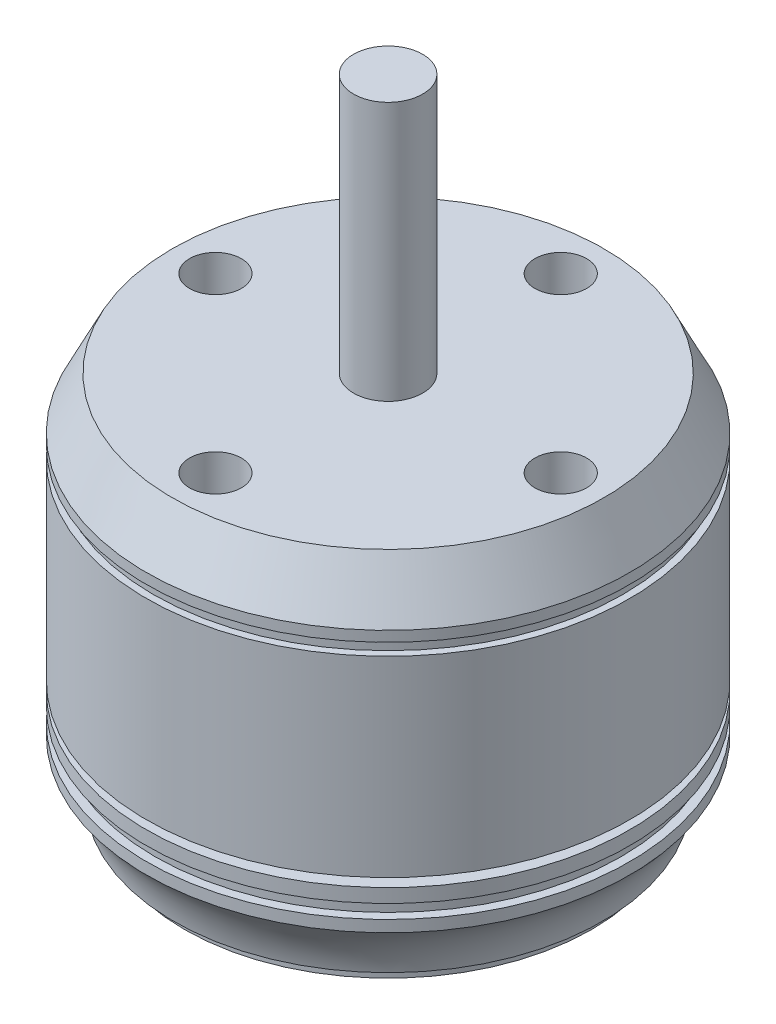
ISO-10303-21;
HEADER;
FILE_DESCRIPTION(('STEP AP214'),'2;1');
FILE_NAME('part.step','',(''),(''),'','','');
FILE_SCHEMA(('AUTOMOTIVE_DESIGN { 1 0 10303 214 1 1 1 1 }'));
ENDSEC;
DATA;
#1=APPLICATION_CONTEXT('core data for automotive mechanical design processes');
#2=APPLICATION_PROTOCOL_DEFINITION('international standard','automotive_design',2000,#1);
#3=PRODUCT_CONTEXT('',#1,'mechanical');
#4=PRODUCT('Part','Part','',(#3));
#5=PRODUCT_RELATED_PRODUCT_CATEGORY('part','',(#4));
#6=PRODUCT_DEFINITION_FORMATION('','',#4);
#7=PRODUCT_DEFINITION_CONTEXT('part definition',#1,'design');
#8=PRODUCT_DEFINITION('design','',#6,#7);
#9=PRODUCT_DEFINITION_SHAPE('','',#8);
#10=(LENGTH_UNIT() NAMED_UNIT(*) SI_UNIT(.MILLI.,.METRE.));
#11=(NAMED_UNIT(*) PLANE_ANGLE_UNIT() SI_UNIT($,.RADIAN.));
#12=(NAMED_UNIT(*) SI_UNIT($,.STERADIAN.) SOLID_ANGLE_UNIT());
#13=UNCERTAINTY_MEASURE_WITH_UNIT(LENGTH_MEASURE(1.E-05),#10,'distance_accuracy_value','');
#14=(GEOMETRIC_REPRESENTATION_CONTEXT(3) GLOBAL_UNCERTAINTY_ASSIGNED_CONTEXT((#13)) GLOBAL_UNIT_ASSIGNED_CONTEXT((#10,
#11,#12)) REPRESENTATION_CONTEXT('',''));
#15=CARTESIAN_POINT('',(0.,0.,0.));
#16=DIRECTION('',(0.,0.,1.));
#17=DIRECTION('',(1.,0.,0.));
#18=AXIS2_PLACEMENT_3D('',#15,#16,#17);
#19=CARTESIAN_POINT('',(0.,0.,0.));
#20=DIRECTION('',(0.,1.,0.));
#21=DIRECTION('',(-1.,0.,0.));
#22=AXIS2_PLACEMENT_3D('',#19,#20,#21);
#23=PLANE('',#22);
#24=CARTESIAN_POINT('',(9.5,0.,0.));
#25=DIRECTION('',(0.,-1.,0.));
#26=DIRECTION('',(1.,0.,0.));
#27=AXIS2_PLACEMENT_3D('',#24,#25,#26);
#28=CIRCLE('',#27,1.5);
#29=CARTESIAN_POINT('',(11.,0.,0.));
#30=VERTEX_POINT('',#29);
#31=EDGE_CURVE('E121',#30,#30,#28,.T.);
#32=ORIENTED_EDGE('',*,*,#31,.F.);
#33=EDGE_LOOP('',(#32));
#34=FACE_BOUND('',#33,.T.);
#35=CARTESIAN_POINT('',(0.,0.,8.));
#36=DIRECTION('',(0.,-1.,0.));
#37=DIRECTION('',(1.,0.,0.));
#38=AXIS2_PLACEMENT_3D('',#35,#36,#37);
#39=CIRCLE('',#38,1.5);
#40=CARTESIAN_POINT('',(1.5,0.,8.));
#41=VERTEX_POINT('',#40);
#42=EDGE_CURVE('E115',#41,#41,#39,.T.);
#43=ORIENTED_EDGE('',*,*,#42,.F.);
#44=EDGE_LOOP('',(#43));
#45=FACE_BOUND('',#44,.T.);
#46=CARTESIAN_POINT('',(0.,0.,-8.));
#47=DIRECTION('',(0.,-1.,0.));
#48=DIRECTION('',(1.,0.,0.));
#49=AXIS2_PLACEMENT_3D('',#46,#47,#48);
#50=CIRCLE('',#49,1.5);
#51=CARTESIAN_POINT('',(1.5,0.,-8.));
#52=VERTEX_POINT('',#51);
#53=EDGE_CURVE('E109',#52,#52,#50,.T.);
#54=ORIENTED_EDGE('',*,*,#53,.F.);
#55=EDGE_LOOP('',(#54));
#56=FACE_BOUND('',#55,.T.);
#57=CARTESIAN_POINT('',(-9.5,0.,0.));
#58=DIRECTION('',(0.,-1.,0.));
#59=DIRECTION('',(1.,0.,0.));
#60=AXIS2_PLACEMENT_3D('',#57,#58,#59);
#61=CIRCLE('',#60,1.5);
#62=CARTESIAN_POINT('',(-8.,0.,0.));
#63=VERTEX_POINT('',#62);
#64=EDGE_CURVE('E102',#63,#63,#61,.T.);
#65=ORIENTED_EDGE('',*,*,#64,.F.);
#66=EDGE_LOOP('',(#65));
#67=FACE_BOUND('',#66,.T.);
#68=CARTESIAN_POINT('',(0.,0.,0.));
#69=DIRECTION('',(0.,1.,0.));
#70=DIRECTION('',(-1.,0.,0.));
#71=AXIS2_PLACEMENT_3D('',#68,#69,#70);
#72=CIRCLE('',#71,11.8);
#73=CARTESIAN_POINT('',(-11.8,0.,0.));
#74=VERTEX_POINT('',#73);
#75=EDGE_CURVE('E10',#74,#74,#72,.T.);
#76=ORIENTED_EDGE('',*,*,#75,.F.);
#77=EDGE_LOOP('',(#76));
#78=FACE_BOUND('',#77,.T.);
#79=ADVANCED_FACE('F34',(#34,#45,#56,#67,#78),#23,.F.);
#80=CARTESIAN_POINT('',(0.,37.,0.));
#81=DIRECTION('',(0.,1.,0.));
#82=DIRECTION('',(-1.,0.,0.));
#83=AXIS2_PLACEMENT_3D('',#80,#81,#82);
#84=CYLINDRICAL_SURFACE('',#83,11.8);
#85=CARTESIAN_POINT('',(0.,0.699999999999999,0.));
#86=DIRECTION('',(0.,1.,0.));
#87=DIRECTION('',(-1.,0.,0.));
#88=AXIS2_PLACEMENT_3D('',#85,#86,#87);
#89=CIRCLE('',#88,11.8);
#90=CARTESIAN_POINT('',(-11.8,0.7,0.));
#91=VERTEX_POINT('',#90);
#92=EDGE_CURVE('E40',#91,#91,#89,.T.);
#93=ORIENTED_EDGE('',*,*,#92,.F.);
#94=EDGE_LOOP('',(#93));
#95=FACE_BOUND('',#94,.T.);
#96=ORIENTED_EDGE('',*,*,#75,.T.);
#97=EDGE_LOOP('',(#96));
#98=FACE_BOUND('',#97,.T.);
#99=ADVANCED_FACE('F266',(#95,#98),#84,.T.);
#100=CARTESIAN_POINT('',(11.8,0.7,0.));
#101=DIRECTION('',(0.,1.,0.));
#102=DIRECTION('',(-1.,0.,0.));
#103=AXIS2_PLACEMENT_3D('',#100,#101,#102);
#104=PLANE('',#103);
#105=CARTESIAN_POINT('',(0.,0.699999999999999,0.));
#106=DIRECTION('',(0.,1.,0.));
#107=DIRECTION('',(-1.,0.,0.));
#108=AXIS2_PLACEMENT_3D('',#105,#106,#107);
#109=CIRCLE('',#108,12.4);
#110=CARTESIAN_POINT('',(-12.4,0.7,0.));
#111=VERTEX_POINT('',#110);
#112=EDGE_CURVE('E44',#111,#111,#109,.T.);
#113=ORIENTED_EDGE('',*,*,#112,.F.);
#114=EDGE_LOOP('',(#113));
#115=FACE_BOUND('',#114,.T.);
#116=ORIENTED_EDGE('',*,*,#92,.T.);
#117=EDGE_LOOP('',(#116));
#118=FACE_BOUND('',#117,.T.);
#119=ADVANCED_FACE('F261',(#115,#118),#104,.F.);
#120=CARTESIAN_POINT('',(0.,-0.34616473227057,0.));
#121=DIRECTION('',(0.,1.,0.));
#122=DIRECTION('',(-1.,0.,0.));
#123=AXIS2_PLACEMENT_3D('',#120,#121,#122);
#124=TOROIDAL_SURFACE('',#123,18.3080910075043,6.);
#125=CARTESIAN_POINT('',(0.,3.83,0.));
#126=DIRECTION('',(0.,1.,0.));
#127=DIRECTION('',(-1.,0.,0.));
#128=AXIS2_PLACEMENT_3D('',#125,#126,#127);
#129=CIRCLE('',#128,14.);
#130=CARTESIAN_POINT('',(-14.,3.83,0.));
#131=VERTEX_POINT('',#130);
#132=EDGE_CURVE('E48',#131,#131,#129,.T.);
#133=ORIENTED_EDGE('',*,*,#132,.F.);
#134=EDGE_LOOP('',(#133));
#135=FACE_BOUND('',#134,.T.);
#136=ORIENTED_EDGE('',*,*,#112,.T.);
#137=EDGE_LOOP('',(#136));
#138=FACE_BOUND('',#137,.T.);
#139=ADVANCED_FACE('F255',(#135,#138),#124,.F.);
#140=CARTESIAN_POINT('',(0.,37.,0.));
#141=DIRECTION('',(0.,1.,0.));
#142=DIRECTION('',(-1.,0.,0.));
#143=AXIS2_PLACEMENT_3D('',#140,#141,#142);
#144=CYLINDRICAL_SURFACE('',#143,14.);
#145=CARTESIAN_POINT('',(0.,4.5,0.));
#146=DIRECTION('',(0.,1.,0.));
#147=DIRECTION('',(-1.,0.,0.));
#148=AXIS2_PLACEMENT_3D('',#145,#146,#147);
#149=CIRCLE('',#148,14.);
#150=CARTESIAN_POINT('',(-14.,4.5,0.));
#151=VERTEX_POINT('',#150);
#152=EDGE_CURVE('E53',#151,#151,#149,.T.);
#153=ORIENTED_EDGE('',*,*,#152,.F.);
#154=EDGE_LOOP('',(#153));
#155=FACE_BOUND('',#154,.T.);
#156=ORIENTED_EDGE('',*,*,#132,.T.);
#157=EDGE_LOOP('',(#156));
#158=FACE_BOUND('',#157,.T.);
#159=ADVANCED_FACE('F249',(#155,#158),#144,.T.);
#160=CARTESIAN_POINT('',(14.,4.5,0.));
#161=DIRECTION('',(0.,-1.,0.));
#162=DIRECTION('',(1.,0.,0.));
#163=AXIS2_PLACEMENT_3D('',#160,#161,#162);
#164=PLANE('',#163);
#165=CARTESIAN_POINT('',(0.,4.5,0.));
#166=DIRECTION('',(0.,1.,0.));
#167=DIRECTION('',(-1.,0.,0.));
#168=AXIS2_PLACEMENT_3D('',#165,#166,#167);
#169=CIRCLE('',#168,13.5);
#170=CARTESIAN_POINT('',(-13.5,4.5,0.));
#171=VERTEX_POINT('',#170);
#172=EDGE_CURVE('E56',#171,#171,#169,.T.);
#173=ORIENTED_EDGE('',*,*,#172,.F.);
#174=EDGE_LOOP('',(#173));
#175=FACE_BOUND('',#174,.T.);
#176=ORIENTED_EDGE('',*,*,#152,.T.);
#177=EDGE_LOOP('',(#176));
#178=FACE_BOUND('',#177,.T.);
#179=ADVANCED_FACE('F243',(#175,#178),#164,.F.);
#180=CARTESIAN_POINT('',(0.,37.,0.));
#181=DIRECTION('',(0.,1.,0.));
#182=DIRECTION('',(-1.,0.,0.));
#183=AXIS2_PLACEMENT_3D('',#180,#181,#182);
#184=CYLINDRICAL_SURFACE('',#183,13.5);
#185=CARTESIAN_POINT('',(0.,5.3,0.));
#186=DIRECTION('',(0.,1.,0.));
#187=DIRECTION('',(-1.,0.,0.));
#188=AXIS2_PLACEMENT_3D('',#185,#186,#187);
#189=CIRCLE('',#188,13.5);
#190=CARTESIAN_POINT('',(-13.5,5.3,0.));
#191=VERTEX_POINT('',#190);
#192=EDGE_CURVE('E59',#191,#191,#189,.T.);
#193=ORIENTED_EDGE('',*,*,#192,.F.);
#194=EDGE_LOOP('',(#193));
#195=FACE_BOUND('',#194,.T.);
#196=ORIENTED_EDGE('',*,*,#172,.T.);
#197=EDGE_LOOP('',(#196));
#198=FACE_BOUND('',#197,.T.);
#199=ADVANCED_FACE('F237',(#195,#198),#184,.T.);
#200=CARTESIAN_POINT('',(13.5,5.3,0.));
#201=DIRECTION('',(0.,1.,0.));
#202=DIRECTION('',(-1.,0.,0.));
#203=AXIS2_PLACEMENT_3D('',#200,#201,#202);
#204=PLANE('',#203);
#205=CARTESIAN_POINT('',(0.,5.3,0.));
#206=DIRECTION('',(0.,1.,0.));
#207=DIRECTION('',(-1.,0.,0.));
#208=AXIS2_PLACEMENT_3D('',#205,#206,#207);
#209=CIRCLE('',#208,14.);
#210=CARTESIAN_POINT('',(-14.,5.3,0.));
#211=VERTEX_POINT('',#210);
#212=EDGE_CURVE('E62',#211,#211,#209,.T.);
#213=ORIENTED_EDGE('',*,*,#212,.F.);
#214=EDGE_LOOP('',(#213));
#215=FACE_BOUND('',#214,.T.);
#216=ORIENTED_EDGE('',*,*,#192,.T.);
#217=EDGE_LOOP('',(#216));
#218=FACE_BOUND('',#217,.T.);
#219=ADVANCED_FACE('F231',(#215,#218),#204,.F.);
#220=CARTESIAN_POINT('',(0.,37.,0.));
#221=DIRECTION('',(0.,1.,0.));
#222=DIRECTION('',(-1.,0.,0.));
#223=AXIS2_PLACEMENT_3D('',#220,#221,#222);
#224=CYLINDRICAL_SURFACE('',#223,14.);
#225=CARTESIAN_POINT('',(0.,6.1,0.));
#226=DIRECTION('',(0.,1.,0.));
#227=DIRECTION('',(-1.,0.,0.));
#228=AXIS2_PLACEMENT_3D('',#225,#226,#227);
#229=CIRCLE('',#228,14.);
#230=CARTESIAN_POINT('',(-14.,6.1,0.));
#231=VERTEX_POINT('',#230);
#232=EDGE_CURVE('E65',#231,#231,#229,.T.);
#233=ORIENTED_EDGE('',*,*,#232,.F.);
#234=EDGE_LOOP('',(#233));
#235=FACE_BOUND('',#234,.T.);
#236=ORIENTED_EDGE('',*,*,#212,.T.);
#237=EDGE_LOOP('',(#236));
#238=FACE_BOUND('',#237,.T.);
#239=ADVANCED_FACE('F225',(#235,#238),#224,.T.);
#240=CARTESIAN_POINT('',(14.,6.1,0.));
#241=DIRECTION('',(0.,-1.,0.));
#242=DIRECTION('',(1.,0.,0.));
#243=AXIS2_PLACEMENT_3D('',#240,#241,#242);
#244=PLANE('',#243);
#245=CARTESIAN_POINT('',(0.,6.09999999999999,0.));
#246=DIRECTION('',(0.,1.,0.));
#247=DIRECTION('',(-1.,0.,0.));
#248=AXIS2_PLACEMENT_3D('',#245,#246,#247);
#249=CIRCLE('',#248,2.);
#250=CARTESIAN_POINT('',(-2.,6.09999999999999,0.));
#251=VERTEX_POINT('',#250);
#252=EDGE_CURVE('E68',#251,#251,#249,.T.);
#253=ORIENTED_EDGE('',*,*,#252,.F.);
#254=EDGE_LOOP('',(#253));
#255=FACE_BOUND('',#254,.T.);
#256=ORIENTED_EDGE('',*,*,#232,.T.);
#257=EDGE_LOOP('',(#256));
#258=FACE_BOUND('',#257,.T.);
#259=ADVANCED_FACE('F219',(#255,#258),#244,.F.);
#260=CARTESIAN_POINT('',(0.,37.,0.));
#261=DIRECTION('',(0.,1.,0.));
#262=DIRECTION('',(-1.,0.,0.));
#263=AXIS2_PLACEMENT_3D('',#260,#261,#262);
#264=CYLINDRICAL_SURFACE('',#263,2.);
#265=CARTESIAN_POINT('',(0.,6.6,0.));
#266=DIRECTION('',(0.,1.,0.));
#267=DIRECTION('',(-1.,0.,0.));
#268=AXIS2_PLACEMENT_3D('',#265,#266,#267);
#269=CIRCLE('',#268,2.);
#270=CARTESIAN_POINT('',(-2.,6.6,0.));
#271=VERTEX_POINT('',#270);
#272=EDGE_CURVE('E71',#271,#271,#269,.T.);
#273=ORIENTED_EDGE('',*,*,#272,.F.);
#274=EDGE_LOOP('',(#273));
#275=FACE_BOUND('',#274,.T.);
#276=ORIENTED_EDGE('',*,*,#252,.T.);
#277=EDGE_LOOP('',(#276));
#278=FACE_BOUND('',#277,.T.);
#279=ADVANCED_FACE('F213',(#275,#278),#264,.T.);
#280=CARTESIAN_POINT('',(2.,6.6,0.));
#281=DIRECTION('',(0.,1.,0.));
#282=DIRECTION('',(-1.,0.,0.));
#283=AXIS2_PLACEMENT_3D('',#280,#281,#282);
#284=PLANE('',#283);
#285=CARTESIAN_POINT('',(0.,6.6,0.));
#286=DIRECTION('',(0.,1.,0.));
#287=DIRECTION('',(-1.,0.,0.));
#288=AXIS2_PLACEMENT_3D('',#285,#286,#287);
#289=CIRCLE('',#288,14.);
#290=CARTESIAN_POINT('',(-14.,6.6,0.));
#291=VERTEX_POINT('',#290);
#292=EDGE_CURVE('E74',#291,#291,#289,.T.);
#293=ORIENTED_EDGE('',*,*,#292,.F.);
#294=EDGE_LOOP('',(#293));
#295=FACE_BOUND('',#294,.T.);
#296=ORIENTED_EDGE('',*,*,#272,.T.);
#297=EDGE_LOOP('',(#296));
#298=FACE_BOUND('',#297,.T.);
#299=ADVANCED_FACE('F207',(#295,#298),#284,.F.);
#300=CARTESIAN_POINT('',(0.,37.,0.));
#301=DIRECTION('',(0.,1.,0.));
#302=DIRECTION('',(-1.,0.,0.));
#303=AXIS2_PLACEMENT_3D('',#300,#301,#302);
#304=CYLINDRICAL_SURFACE('',#303,14.);
#305=CARTESIAN_POINT('',(0.,17.7,0.));
#306=DIRECTION('',(0.,1.,0.));
#307=DIRECTION('',(-1.,0.,0.));
#308=AXIS2_PLACEMENT_3D('',#305,#306,#307);
#309=CIRCLE('',#308,14.);
#310=CARTESIAN_POINT('',(-14.,17.7,0.));
#311=VERTEX_POINT('',#310);
#312=EDGE_CURVE('E77',#311,#311,#309,.T.);
#313=ORIENTED_EDGE('',*,*,#312,.F.);
#314=EDGE_LOOP('',(#313));
#315=FACE_BOUND('',#314,.T.);
#316=ORIENTED_EDGE('',*,*,#292,.T.);
#317=EDGE_LOOP('',(#316));
#318=FACE_BOUND('',#317,.T.);
#319=ADVANCED_FACE('F201',(#315,#318),#304,.T.);
#320=CARTESIAN_POINT('',(14.,17.7,0.));
#321=DIRECTION('',(0.,-1.,0.));
#322=DIRECTION('',(1.,0.,0.));
#323=AXIS2_PLACEMENT_3D('',#320,#321,#322);
#324=PLANE('',#323);
#325=CARTESIAN_POINT('',(0.,17.7,0.));
#326=DIRECTION('',(0.,1.,0.));
#327=DIRECTION('',(-1.,0.,0.));
#328=AXIS2_PLACEMENT_3D('',#325,#326,#327);
#329=CIRCLE('',#328,13.6);
#330=CARTESIAN_POINT('',(-13.6,17.7,0.));
#331=VERTEX_POINT('',#330);
#332=EDGE_CURVE('E80',#331,#331,#329,.T.);
#333=ORIENTED_EDGE('',*,*,#332,.F.);
#334=EDGE_LOOP('',(#333));
#335=FACE_BOUND('',#334,.T.);
#336=ORIENTED_EDGE('',*,*,#312,.T.);
#337=EDGE_LOOP('',(#336));
#338=FACE_BOUND('',#337,.T.);
#339=ADVANCED_FACE('F195',(#335,#338),#324,.F.);
#340=CARTESIAN_POINT('',(0.,37.,0.));
#341=DIRECTION('',(0.,1.,0.));
#342=DIRECTION('',(-1.,0.,0.));
#343=AXIS2_PLACEMENT_3D('',#340,#341,#342);
#344=CYLINDRICAL_SURFACE('',#343,13.6);
#345=CARTESIAN_POINT('',(0.,18.4,0.));
#346=DIRECTION('',(0.,1.,0.));
#347=DIRECTION('',(-1.,0.,0.));
#348=AXIS2_PLACEMENT_3D('',#345,#346,#347);
#349=CIRCLE('',#348,13.6);
#350=CARTESIAN_POINT('',(-13.6,18.4,0.));
#351=VERTEX_POINT('',#350);
#352=EDGE_CURVE('E83',#351,#351,#349,.T.);
#353=ORIENTED_EDGE('',*,*,#352,.F.);
#354=EDGE_LOOP('',(#353));
#355=FACE_BOUND('',#354,.T.);
#356=ORIENTED_EDGE('',*,*,#332,.T.);
#357=EDGE_LOOP('',(#356));
#358=FACE_BOUND('',#357,.T.);
#359=ADVANCED_FACE('F189',(#355,#358),#344,.T.);
#360=CARTESIAN_POINT('',(13.6,18.4,0.));
#361=DIRECTION('',(0.,1.,0.));
#362=DIRECTION('',(-1.,0.,0.));
#363=AXIS2_PLACEMENT_3D('',#360,#361,#362);
#364=PLANE('',#363);
#365=CARTESIAN_POINT('',(0.,18.4,0.));
#366=DIRECTION('',(0.,1.,0.));
#367=DIRECTION('',(-1.,0.,0.));
#368=AXIS2_PLACEMENT_3D('',#365,#366,#367);
#369=CIRCLE('',#368,14.);
#370=CARTESIAN_POINT('',(-14.,18.4,0.));
#371=VERTEX_POINT('',#370);
#372=EDGE_CURVE('E86',#371,#371,#369,.T.);
#373=ORIENTED_EDGE('',*,*,#372,.F.);
#374=EDGE_LOOP('',(#373));
#375=FACE_BOUND('',#374,.T.);
#376=ORIENTED_EDGE('',*,*,#352,.T.);
#377=EDGE_LOOP('',(#376));
#378=FACE_BOUND('',#377,.T.);
#379=ADVANCED_FACE('F183',(#375,#378),#364,.F.);
#380=CARTESIAN_POINT('',(0.,37.,0.));
#381=DIRECTION('',(0.,1.,0.));
#382=DIRECTION('',(-1.,0.,0.));
#383=AXIS2_PLACEMENT_3D('',#380,#381,#382);
#384=CYLINDRICAL_SURFACE('',#383,14.);
#385=CARTESIAN_POINT('',(0.,19.,0.));
#386=DIRECTION('',(0.,1.,0.));
#387=DIRECTION('',(-1.,0.,0.));
#388=AXIS2_PLACEMENT_3D('',#385,#386,#387);
#389=CIRCLE('',#388,14.);
#390=CARTESIAN_POINT('',(-14.,19.,0.));
#391=VERTEX_POINT('',#390);
#392=EDGE_CURVE('E89',#391,#391,#389,.T.);
#393=ORIENTED_EDGE('',*,*,#392,.F.);
#394=EDGE_LOOP('',(#393));
#395=FACE_BOUND('',#394,.T.);
#396=ORIENTED_EDGE('',*,*,#372,.T.);
#397=EDGE_LOOP('',(#396));
#398=FACE_BOUND('',#397,.T.);
#399=ADVANCED_FACE('F177',(#395,#398),#384,.T.);
#400=CARTESIAN_POINT('',(0.,19.,0.));
#401=DIRECTION('',(0.,-1.,0.));
#402=DIRECTION('',(1.,0.,0.));
#403=AXIS2_PLACEMENT_3D('',#400,#401,#402);
#404=CONICAL_SURFACE('',#403,14.,0.463647609000807);
#405=CARTESIAN_POINT('',(0.,22.,0.));
#406=DIRECTION('',(0.,1.,0.));
#407=DIRECTION('',(-1.,0.,0.));
#408=AXIS2_PLACEMENT_3D('',#405,#406,#407);
#409=CIRCLE('',#408,12.5);
#410=CARTESIAN_POINT('',(-12.5,22.,0.));
#411=VERTEX_POINT('',#410);
#412=EDGE_CURVE('E92',#411,#411,#409,.T.);
#413=ORIENTED_EDGE('',*,*,#412,.F.);
#414=EDGE_LOOP('',(#413));
#415=FACE_BOUND('',#414,.T.);
#416=ORIENTED_EDGE('',*,*,#392,.T.);
#417=EDGE_LOOP('',(#416));
#418=FACE_BOUND('',#417,.T.);
#419=ADVANCED_FACE('F163',(#415,#418),#404,.T.);
#420=CARTESIAN_POINT('',(12.5,22.,0.));
#421=DIRECTION('',(0.,-1.,0.));
#422=DIRECTION('',(1.,0.,0.));
#423=AXIS2_PLACEMENT_3D('',#420,#421,#422);
#424=PLANE('',#423);
#425=CARTESIAN_POINT('',(0.,22.,-10.));
#426=DIRECTION('',(0.,1.,0.));
#427=DIRECTION('',(-1.,0.,0.));
#428=AXIS2_PLACEMENT_3D('',#425,#426,#427);
#429=CIRCLE('',#428,1.5);
#430=CARTESIAN_POINT('',(-1.5,22.,-10.));
#431=VERTEX_POINT('',#430);
#432=EDGE_CURVE('E144',#431,#431,#429,.T.);
#433=ORIENTED_EDGE('',*,*,#432,.F.);
#434=EDGE_LOOP('',(#433));
#435=FACE_BOUND('',#434,.T.);
#436=CARTESIAN_POINT('',(10.,22.,0.));
#437=DIRECTION('',(0.,1.,0.));
#438=DIRECTION('',(-1.,0.,0.));
#439=AXIS2_PLACEMENT_3D('',#436,#437,#438);
#440=CIRCLE('',#439,1.5);
#441=CARTESIAN_POINT('',(8.5,22.,0.));
#442=VERTEX_POINT('',#441);
#443=EDGE_CURVE('E138',#442,#442,#440,.T.);
#444=ORIENTED_EDGE('',*,*,#443,.F.);
#445=EDGE_LOOP('',(#444));
#446=FACE_BOUND('',#445,.T.);
#447=CARTESIAN_POINT('',(0.,22.,10.));
#448=DIRECTION('',(0.,1.,0.));
#449=DIRECTION('',(-1.,0.,0.));
#450=AXIS2_PLACEMENT_3D('',#447,#448,#449);
#451=CIRCLE('',#450,1.5);
#452=CARTESIAN_POINT('',(-1.5,22.,10.));
#453=VERTEX_POINT('',#452);
#454=EDGE_CURVE('E132',#453,#453,#451,.T.);
#455=ORIENTED_EDGE('',*,*,#454,.F.);
#456=EDGE_LOOP('',(#455));
#457=FACE_BOUND('',#456,.T.);
#458=CARTESIAN_POINT('',(-10.,22.,0.));
#459=DIRECTION('',(0.,1.,0.));
#460=DIRECTION('',(-1.,0.,0.));
#461=AXIS2_PLACEMENT_3D('',#458,#459,#460);
#462=CIRCLE('',#461,1.5);
#463=CARTESIAN_POINT('',(-11.5,22.,0.));
#464=VERTEX_POINT('',#463);
#465=EDGE_CURVE('E126',#464,#464,#462,.T.);
#466=ORIENTED_EDGE('',*,*,#465,.F.);
#467=EDGE_LOOP('',(#466));
#468=FACE_BOUND('',#467,.T.);
#469=CARTESIAN_POINT('',(0.,22.,0.));
#470=DIRECTION('',(0.,1.,0.));
#471=DIRECTION('',(-1.,0.,0.));
#472=AXIS2_PLACEMENT_3D('',#469,#470,#471);
#473=CIRCLE('',#472,2.);
#474=CARTESIAN_POINT('',(-2.,22.,0.));
#475=VERTEX_POINT('',#474);
#476=EDGE_CURVE('E95',#475,#475,#473,.T.);
#477=ORIENTED_EDGE('',*,*,#476,.F.);
#478=EDGE_LOOP('',(#477));
#479=FACE_BOUND('',#478,.T.);
#480=ORIENTED_EDGE('',*,*,#412,.T.);
#481=EDGE_LOOP('',(#480));
#482=FACE_BOUND('',#481,.T.);
#483=ADVANCED_FACE('F159',(#435,#446,#457,#468,#479,#482),#424,.F.);
#484=CARTESIAN_POINT('',(0.,37.,0.));
#485=DIRECTION('',(0.,1.,0.));
#486=DIRECTION('',(-1.,0.,0.));
#487=AXIS2_PLACEMENT_3D('',#484,#485,#486);
#488=CYLINDRICAL_SURFACE('',#487,2.);
#489=CARTESIAN_POINT('',(0.,37.,0.));
#490=DIRECTION('',(0.,1.,0.));
#491=DIRECTION('',(-1.,0.,0.));
#492=AXIS2_PLACEMENT_3D('',#489,#490,#491);
#493=CIRCLE('',#492,2.);
#494=CARTESIAN_POINT('',(-2.,37.,0.));
#495=VERTEX_POINT('',#494);
#496=EDGE_CURVE('E98',#495,#495,#493,.T.);
#497=ORIENTED_EDGE('',*,*,#496,.F.);
#498=EDGE_LOOP('',(#497));
#499=FACE_BOUND('',#498,.T.);
#500=ORIENTED_EDGE('',*,*,#476,.T.);
#501=EDGE_LOOP('',(#500));
#502=FACE_BOUND('',#501,.T.);
#503=ADVANCED_FACE('F162',(#499,#502),#488,.T.);
#504=CARTESIAN_POINT('',(2.,37.,0.));
#505=DIRECTION('',(0.,-1.,0.));
#506=DIRECTION('',(1.,0.,0.));
#507=AXIS2_PLACEMENT_3D('',#504,#505,#506);
#508=PLANE('',#507);
#509=ORIENTED_EDGE('',*,*,#496,.T.);
#510=EDGE_LOOP('',(#509));
#511=FACE_BOUND('',#510,.T.);
#512=ADVANCED_FACE('F288',(#511),#508,.F.);
#513=CARTESIAN_POINT('',(-9.5,3.,0.));
#514=DIRECTION('',(0.,-1.,0.));
#515=DIRECTION('',(1.,0.,0.));
#516=AXIS2_PLACEMENT_3D('',#513,#514,#515);
#517=CYLINDRICAL_SURFACE('',#516,1.5);
#518=CARTESIAN_POINT('',(-9.5,3.,0.));
#519=DIRECTION('',(0.,-1.,0.));
#520=DIRECTION('',(1.,0.,0.));
#521=AXIS2_PLACEMENT_3D('',#518,#519,#520);
#522=CIRCLE('',#521,1.5);
#523=CARTESIAN_POINT('',(-8.,3.,0.));
#524=VERTEX_POINT('',#523);
#525=EDGE_CURVE('E105',#524,#524,#522,.T.);
#526=ORIENTED_EDGE('',*,*,#525,.F.);
#527=EDGE_LOOP('',(#526));
#528=FACE_BOUND('',#527,.T.);
#529=ORIENTED_EDGE('',*,*,#64,.T.);
#530=EDGE_LOOP('',(#529));
#531=FACE_BOUND('',#530,.T.);
#532=ADVANCED_FACE('F285',(#528,#531),#517,.F.);
#533=CARTESIAN_POINT('',(-9.5,3.,0.));
#534=DIRECTION('',(0.,-1.,0.));
#535=DIRECTION('',(1.,0.,0.));
#536=AXIS2_PLACEMENT_3D('',#533,#534,#535);
#537=PLANE('',#536);
#538=ORIENTED_EDGE('',*,*,#525,.T.);
#539=EDGE_LOOP('',(#538));
#540=FACE_BOUND('',#539,.T.);
#541=ADVANCED_FACE('F287',(#540),#537,.T.);
#542=CARTESIAN_POINT('',(0.,3.,-8.));
#543=DIRECTION('',(0.,-1.,0.));
#544=DIRECTION('',(1.,0.,0.));
#545=AXIS2_PLACEMENT_3D('',#542,#543,#544);
#546=CYLINDRICAL_SURFACE('',#545,1.5);
#547=CARTESIAN_POINT('',(0.,3.,-8.));
#548=DIRECTION('',(0.,-1.,0.));
#549=DIRECTION('',(1.,0.,0.));
#550=AXIS2_PLACEMENT_3D('',#547,#548,#549);
#551=CIRCLE('',#550,1.5);
#552=CARTESIAN_POINT('',(1.5,3.,-8.));
#553=VERTEX_POINT('',#552);
#554=EDGE_CURVE('E112',#553,#553,#551,.T.);
#555=ORIENTED_EDGE('',*,*,#554,.F.);
#556=EDGE_LOOP('',(#555));
#557=FACE_BOUND('',#556,.T.);
#558=ORIENTED_EDGE('',*,*,#53,.T.);
#559=EDGE_LOOP('',(#558));
#560=FACE_BOUND('',#559,.T.);
#561=ADVANCED_FACE('F295',(#557,#560),#546,.F.);
#562=CARTESIAN_POINT('',(0.,3.,-8.));
#563=DIRECTION('',(0.,-1.,0.));
#564=DIRECTION('',(1.,0.,0.));
#565=AXIS2_PLACEMENT_3D('',#562,#563,#564);
#566=PLANE('',#565);
#567=ORIENTED_EDGE('',*,*,#554,.T.);
#568=EDGE_LOOP('',(#567));
#569=FACE_BOUND('',#568,.T.);
#570=ADVANCED_FACE('F340',(#569),#566,.T.);
#571=CARTESIAN_POINT('',(0.,3.,8.));
#572=DIRECTION('',(0.,-1.,0.));
#573=DIRECTION('',(1.,0.,0.));
#574=AXIS2_PLACEMENT_3D('',#571,#572,#573);
#575=CYLINDRICAL_SURFACE('',#574,1.5);
#576=CARTESIAN_POINT('',(0.,3.,8.));
#577=DIRECTION('',(0.,-1.,0.));
#578=DIRECTION('',(1.,0.,0.));
#579=AXIS2_PLACEMENT_3D('',#576,#577,#578);
#580=CIRCLE('',#579,1.5);
#581=CARTESIAN_POINT('',(1.5,3.,8.));
#582=VERTEX_POINT('',#581);
#583=EDGE_CURVE('E118',#582,#582,#580,.T.);
#584=ORIENTED_EDGE('',*,*,#583,.F.);
#585=EDGE_LOOP('',(#584));
#586=FACE_BOUND('',#585,.T.);
#587=ORIENTED_EDGE('',*,*,#42,.T.);
#588=EDGE_LOOP('',(#587));
#589=FACE_BOUND('',#588,.T.);
#590=ADVANCED_FACE('F349',(#586,#589),#575,.F.);
#591=CARTESIAN_POINT('',(0.,3.,8.));
#592=DIRECTION('',(0.,-1.,0.));
#593=DIRECTION('',(1.,0.,0.));
#594=AXIS2_PLACEMENT_3D('',#591,#592,#593);
#595=PLANE('',#594);
#596=ORIENTED_EDGE('',*,*,#583,.T.);
#597=EDGE_LOOP('',(#596));
#598=FACE_BOUND('',#597,.T.);
#599=ADVANCED_FACE('F359',(#598),#595,.T.);
#600=CARTESIAN_POINT('',(9.5,3.,0.));
#601=DIRECTION('',(0.,-1.,0.));
#602=DIRECTION('',(1.,0.,0.));
#603=AXIS2_PLACEMENT_3D('',#600,#601,#602);
#604=CYLINDRICAL_SURFACE('',#603,1.5);
#605=CARTESIAN_POINT('',(9.5,3.,0.));
#606=DIRECTION('',(0.,-1.,0.));
#607=DIRECTION('',(1.,0.,0.));
#608=AXIS2_PLACEMENT_3D('',#605,#606,#607);
#609=CIRCLE('',#608,1.5);
#610=CARTESIAN_POINT('',(11.,3.,0.));
#611=VERTEX_POINT('',#610);
#612=EDGE_CURVE('E101',#611,#611,#609,.T.);
#613=ORIENTED_EDGE('',*,*,#612,.F.);
#614=EDGE_LOOP('',(#613));
#615=FACE_BOUND('',#614,.T.);
#616=ORIENTED_EDGE('',*,*,#31,.T.);
#617=EDGE_LOOP('',(#616));
#618=FACE_BOUND('',#617,.T.);
#619=ADVANCED_FACE('F369',(#615,#618),#604,.F.);
#620=CARTESIAN_POINT('',(9.5,3.,0.));
#621=DIRECTION('',(0.,-1.,0.));
#622=DIRECTION('',(1.,0.,0.));
#623=AXIS2_PLACEMENT_3D('',#620,#621,#622);
#624=PLANE('',#623);
#625=ORIENTED_EDGE('',*,*,#612,.T.);
#626=EDGE_LOOP('',(#625));
#627=FACE_BOUND('',#626,.T.);
#628=ADVANCED_FACE('F379',(#627),#624,.T.);
#629=CARTESIAN_POINT('',(-10.,19.2,0.));
#630=DIRECTION('',(0.,1.,0.));
#631=DIRECTION('',(-1.,0.,0.));
#632=AXIS2_PLACEMENT_3D('',#629,#630,#631);
#633=CYLINDRICAL_SURFACE('',#632,1.5);
#634=CARTESIAN_POINT('',(-10.,19.2,0.));
#635=DIRECTION('',(0.,1.,0.));
#636=DIRECTION('',(-1.,0.,0.));
#637=AXIS2_PLACEMENT_3D('',#634,#635,#636);
#638=CIRCLE('',#637,1.5);
#639=CARTESIAN_POINT('',(-11.5,19.2,0.));
#640=VERTEX_POINT('',#639);
#641=EDGE_CURVE('E129',#640,#640,#638,.T.);
#642=ORIENTED_EDGE('',*,*,#641,.F.);
#643=EDGE_LOOP('',(#642));
#644=FACE_BOUND('',#643,.T.);
#645=ORIENTED_EDGE('',*,*,#465,.T.);
#646=EDGE_LOOP('',(#645));
#647=FACE_BOUND('',#646,.T.);
#648=ADVANCED_FACE('F388',(#644,#647),#633,.F.);
#649=CARTESIAN_POINT('',(-10.,19.2,0.));
#650=DIRECTION('',(0.,1.,0.));
#651=DIRECTION('',(-1.,0.,0.));
#652=AXIS2_PLACEMENT_3D('',#649,#650,#651);
#653=PLANE('',#652);
#654=ORIENTED_EDGE('',*,*,#641,.T.);
#655=EDGE_LOOP('',(#654));
#656=FACE_BOUND('',#655,.T.);
#657=ADVANCED_FACE('F404',(#656),#653,.T.);
#658=CARTESIAN_POINT('',(0.,19.2,10.));
#659=DIRECTION('',(0.,1.,0.));
#660=DIRECTION('',(-1.,0.,0.));
#661=AXIS2_PLACEMENT_3D('',#658,#659,#660);
#662=CYLINDRICAL_SURFACE('',#661,1.5);
#663=CARTESIAN_POINT('',(0.,19.2,10.));
#664=DIRECTION('',(0.,1.,0.));
#665=DIRECTION('',(-1.,0.,0.));
#666=AXIS2_PLACEMENT_3D('',#663,#664,#665);
#667=CIRCLE('',#666,1.5);
#668=CARTESIAN_POINT('',(-1.5,19.2,10.));
#669=VERTEX_POINT('',#668);
#670=EDGE_CURVE('E135',#669,#669,#667,.T.);
#671=ORIENTED_EDGE('',*,*,#670,.F.);
#672=EDGE_LOOP('',(#671));
#673=FACE_BOUND('',#672,.T.);
#674=ORIENTED_EDGE('',*,*,#454,.T.);
#675=EDGE_LOOP('',(#674));
#676=FACE_BOUND('',#675,.T.);
#677=ADVANCED_FACE('F414',(#673,#676),#662,.F.);
#678=CARTESIAN_POINT('',(0.,19.2,10.));
#679=DIRECTION('',(0.,1.,0.));
#680=DIRECTION('',(-1.,0.,0.));
#681=AXIS2_PLACEMENT_3D('',#678,#679,#680);
#682=PLANE('',#681);
#683=ORIENTED_EDGE('',*,*,#670,.T.);
#684=EDGE_LOOP('',(#683));
#685=FACE_BOUND('',#684,.T.);
#686=ADVANCED_FACE('F424',(#685),#682,.T.);
#687=CARTESIAN_POINT('',(10.,19.2,0.));
#688=DIRECTION('',(0.,1.,0.));
#689=DIRECTION('',(-1.,0.,0.));
#690=AXIS2_PLACEMENT_3D('',#687,#688,#689);
#691=CYLINDRICAL_SURFACE('',#690,1.5);
#692=CARTESIAN_POINT('',(10.,19.2,0.));
#693=DIRECTION('',(0.,1.,0.));
#694=DIRECTION('',(-1.,0.,0.));
#695=AXIS2_PLACEMENT_3D('',#692,#693,#694);
#696=CIRCLE('',#695,1.5);
#697=CARTESIAN_POINT('',(8.5,19.2,0.));
#698=VERTEX_POINT('',#697);
#699=EDGE_CURVE('E141',#698,#698,#696,.T.);
#700=ORIENTED_EDGE('',*,*,#699,.F.);
#701=EDGE_LOOP('',(#700));
#702=FACE_BOUND('',#701,.T.);
#703=ORIENTED_EDGE('',*,*,#443,.T.);
#704=EDGE_LOOP('',(#703));
#705=FACE_BOUND('',#704,.T.);
#706=ADVANCED_FACE('F434',(#702,#705),#691,.F.);
#707=CARTESIAN_POINT('',(10.,19.2,0.));
#708=DIRECTION('',(0.,1.,0.));
#709=DIRECTION('',(-1.,0.,0.));
#710=AXIS2_PLACEMENT_3D('',#707,#708,#709);
#711=PLANE('',#710);
#712=ORIENTED_EDGE('',*,*,#699,.T.);
#713=EDGE_LOOP('',(#712));
#714=FACE_BOUND('',#713,.T.);
#715=ADVANCED_FACE('F155',(#714),#711,.T.);
#716=CARTESIAN_POINT('',(0.,19.2,-10.));
#717=DIRECTION('',(0.,1.,0.));
#718=DIRECTION('',(-1.,0.,0.));
#719=AXIS2_PLACEMENT_3D('',#716,#717,#718);
#720=CYLINDRICAL_SURFACE('',#719,1.5);
#721=CARTESIAN_POINT('',(0.,19.2,-10.));
#722=DIRECTION('',(0.,1.,0.));
#723=DIRECTION('',(-1.,0.,0.));
#724=AXIS2_PLACEMENT_3D('',#721,#722,#723);
#725=CIRCLE('',#724,1.5);
#726=CARTESIAN_POINT('',(-1.5,19.2,-10.));
#727=VERTEX_POINT('',#726);
#728=EDGE_CURVE('E106',#727,#727,#725,.T.);
#729=ORIENTED_EDGE('',*,*,#728,.F.);
#730=EDGE_LOOP('',(#729));
#731=FACE_BOUND('',#730,.T.);
#732=ORIENTED_EDGE('',*,*,#432,.T.);
#733=EDGE_LOOP('',(#732));
#734=FACE_BOUND('',#733,.T.);
#735=ADVANCED_FACE('F152',(#731,#734),#720,.F.);
#736=CARTESIAN_POINT('',(0.,19.2,-10.));
#737=DIRECTION('',(0.,1.,0.));
#738=DIRECTION('',(-1.,0.,0.));
#739=AXIS2_PLACEMENT_3D('',#736,#737,#738);
#740=PLANE('',#739);
#741=ORIENTED_EDGE('',*,*,#728,.T.);
#742=EDGE_LOOP('',(#741));
#743=FACE_BOUND('',#742,.T.);
#744=ADVANCED_FACE('F150',(#743),#740,.T.);
#745=CLOSED_SHELL('',(#79,#99,#119,#139,#159,#179,#199,#219,#239,#259,#279,#299,#319,#339,#359,
#379,#399,#419,#483,#503,#512,#532,#541,#561,#570,#590,#599,#619,#628,#648,#657,#677,#686,#706,
#715,#735,#744));
#746=MANIFOLD_SOLID_BREP('B2',#745);
#747=ADVANCED_BREP_SHAPE_REPRESENTATION('',(#18,#746),#14);
#748=SHAPE_DEFINITION_REPRESENTATION(#9,#747);
ENDSEC;
END-ISO-10303-21;
